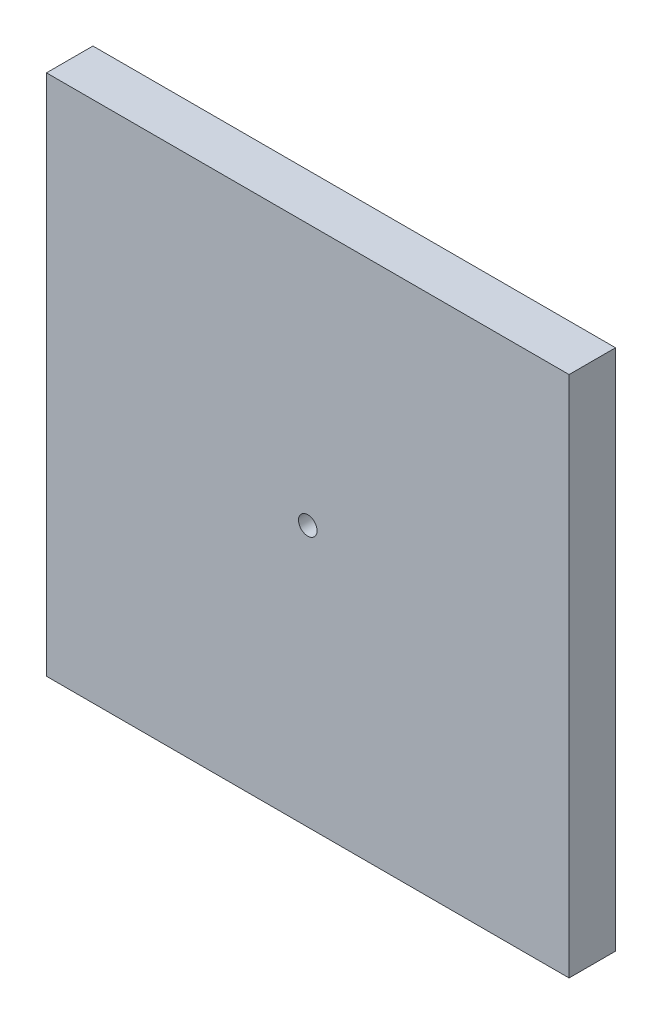
ISO-10303-21;
HEADER;
FILE_DESCRIPTION(('STEP AP214'),'2;1');
FILE_NAME('part.step','',(''),(''),'','','');
FILE_SCHEMA(('AUTOMOTIVE_DESIGN { 1 0 10303 214 1 1 1 1 }'));
ENDSEC;
DATA;
#1=APPLICATION_CONTEXT('core data for automotive mechanical design processes');
#2=APPLICATION_PROTOCOL_DEFINITION('international standard','automotive_design',2000,#1);
#3=PRODUCT_CONTEXT('',#1,'mechanical');
#4=PRODUCT('Part','Part','',(#3));
#5=PRODUCT_RELATED_PRODUCT_CATEGORY('part','',(#4));
#6=PRODUCT_DEFINITION_FORMATION('','',#4);
#7=PRODUCT_DEFINITION_CONTEXT('part definition',#1,'design');
#8=PRODUCT_DEFINITION('design','',#6,#7);
#9=PRODUCT_DEFINITION_SHAPE('','',#8);
#10=(LENGTH_UNIT() NAMED_UNIT(*) SI_UNIT(.MILLI.,.METRE.));
#11=(NAMED_UNIT(*) PLANE_ANGLE_UNIT() SI_UNIT($,.RADIAN.));
#12=(NAMED_UNIT(*) SI_UNIT($,.STERADIAN.) SOLID_ANGLE_UNIT());
#13=UNCERTAINTY_MEASURE_WITH_UNIT(LENGTH_MEASURE(1.E-05),#10,'distance_accuracy_value','');
#14=(GEOMETRIC_REPRESENTATION_CONTEXT(3) GLOBAL_UNCERTAINTY_ASSIGNED_CONTEXT((#13)) GLOBAL_UNIT_ASSIGNED_CONTEXT((#10,
#11,#12)) REPRESENTATION_CONTEXT('',''));
#15=CARTESIAN_POINT('',(0.,0.,0.));
#16=DIRECTION('',(0.,0.,1.));
#17=DIRECTION('',(1.,0.,0.));
#18=AXIS2_PLACEMENT_3D('',#15,#16,#17);
#19=CARTESIAN_POINT('',(0.,0.,4.));
#20=DIRECTION('',(0.,0.,-1.));
#21=DIRECTION('',(-1.,0.,0.));
#22=AXIS2_PLACEMENT_3D('',#19,#20,#21);
#23=PLANE('',#22);
#24=DIRECTION('',(0.,-1.,0.));
#25=VECTOR('',#24,1.);
#26=CARTESIAN_POINT('',(0.,0.,4.));
#27=LINE('',#26,#25);
#28=CARTESIAN_POINT('',(0.,45.,4.));
#29=VERTEX_POINT('',#28);
#30=CARTESIAN_POINT('',(0.,0.,4.));
#31=VERTEX_POINT('',#30);
#32=EDGE_CURVE('E85',#29,#31,#27,.T.);
#33=ORIENTED_EDGE('',*,*,#32,.T.);
#34=DIRECTION('',(1.,0.,0.));
#35=VECTOR('',#34,1.);
#36=CARTESIAN_POINT('',(0.,0.,4.));
#37=LINE('',#36,#35);
#38=CARTESIAN_POINT('',(45.,0.,4.));
#39=VERTEX_POINT('',#38);
#40=EDGE_CURVE('E80',#31,#39,#37,.T.);
#41=ORIENTED_EDGE('',*,*,#40,.T.);
#42=DIRECTION('',(0.,1.,0.));
#43=VECTOR('',#42,1.);
#44=CARTESIAN_POINT('',(45.,0.,4.));
#45=LINE('',#44,#43);
#46=CARTESIAN_POINT('',(45.,45.,4.));
#47=VERTEX_POINT('',#46);
#48=EDGE_CURVE('E83',#39,#47,#45,.T.);
#49=ORIENTED_EDGE('',*,*,#48,.T.);
#50=DIRECTION('',(-1.,0.,0.));
#51=VECTOR('',#50,1.);
#52=CARTESIAN_POINT('',(0.,45.,4.));
#53=LINE('',#52,#51);
#54=EDGE_CURVE('E50',#47,#29,#53,.T.);
#55=ORIENTED_EDGE('',*,*,#54,.T.);
#56=EDGE_LOOP('',(#33,#41,#49,#55));
#57=FACE_BOUND('',#56,.T.);
#58=CARTESIAN_POINT('',(22.5,22.5,4.));
#59=DIRECTION('',(0.,0.,1.));
#60=DIRECTION('',(1.,0.,0.));
#61=AXIS2_PLACEMENT_3D('',#58,#59,#60);
#62=CIRCLE('',#61,0.799999999999999);
#63=CARTESIAN_POINT('',(23.3,22.5,4.));
#64=VERTEX_POINT('',#63);
#65=EDGE_CURVE('E100',#64,#64,#62,.T.);
#66=ORIENTED_EDGE('',*,*,#65,.F.);
#67=EDGE_LOOP('',(#66));
#68=FACE_BOUND('',#67,.T.);
#69=ADVANCED_FACE('F33',(#57,#68),#23,.F.);
#70=CARTESIAN_POINT('',(0.,0.,0.));
#71=DIRECTION('',(0.,0.,-1.));
#72=DIRECTION('',(-1.,0.,0.));
#73=AXIS2_PLACEMENT_3D('',#70,#71,#72);
#74=PLANE('',#73);
#75=DIRECTION('',(0.,-1.,0.));
#76=VECTOR('',#75,1.);
#77=CARTESIAN_POINT('',(0.,0.,0.));
#78=LINE('',#77,#76);
#79=CARTESIAN_POINT('',(0.,45.,0.));
#80=VERTEX_POINT('',#79);
#81=CARTESIAN_POINT('',(0.,0.,0.));
#82=VERTEX_POINT('',#81);
#83=EDGE_CURVE('E97',#80,#82,#78,.T.);
#84=ORIENTED_EDGE('',*,*,#83,.F.);
#85=DIRECTION('',(-1.,0.,0.));
#86=VECTOR('',#85,1.);
#87=CARTESIAN_POINT('',(0.,45.,0.));
#88=LINE('',#87,#86);
#89=CARTESIAN_POINT('',(45.,45.,0.));
#90=VERTEX_POINT('',#89);
#91=EDGE_CURVE('E73',#90,#80,#88,.T.);
#92=ORIENTED_EDGE('',*,*,#91,.F.);
#93=DIRECTION('',(0.,1.,0.));
#94=VECTOR('',#93,1.);
#95=CARTESIAN_POINT('',(45.,0.,0.));
#96=LINE('',#95,#94);
#97=CARTESIAN_POINT('',(45.,0.,0.));
#98=VERTEX_POINT('',#97);
#99=EDGE_CURVE('E67',#98,#90,#96,.T.);
#100=ORIENTED_EDGE('',*,*,#99,.F.);
#101=DIRECTION('',(1.,0.,0.));
#102=VECTOR('',#101,1.);
#103=CARTESIAN_POINT('',(0.,0.,0.));
#104=LINE('',#103,#102);
#105=EDGE_CURVE('E89',#82,#98,#104,.T.);
#106=ORIENTED_EDGE('',*,*,#105,.F.);
#107=EDGE_LOOP('',(#84,#92,#100,#106));
#108=FACE_BOUND('',#107,.T.);
#109=CARTESIAN_POINT('',(22.5,22.5,0.));
#110=DIRECTION('',(0.,0.,1.));
#111=DIRECTION('',(1.,0.,0.));
#112=AXIS2_PLACEMENT_3D('',#109,#110,#111);
#113=CIRCLE('',#112,0.799999999999999);
#114=CARTESIAN_POINT('',(23.3,22.5,0.));
#115=VERTEX_POINT('',#114);
#116=EDGE_CURVE('E112',#115,#115,#113,.T.);
#117=ORIENTED_EDGE('',*,*,#116,.T.);
#118=EDGE_LOOP('',(#117));
#119=FACE_BOUND('',#118,.T.);
#120=ADVANCED_FACE('F108',(#108,#119),#74,.T.);
#121=CARTESIAN_POINT('',(0.,0.,4.));
#122=DIRECTION('',(1.,0.,0.));
#123=DIRECTION('',(0.,0.,-1.));
#124=AXIS2_PLACEMENT_3D('',#121,#122,#123);
#125=PLANE('',#124);
#126=ORIENTED_EDGE('',*,*,#83,.T.);
#127=DIRECTION('',(0.,0.,-1.));
#128=VECTOR('',#127,1.);
#129=CARTESIAN_POINT('',(0.,0.,4.));
#130=LINE('',#129,#128);
#131=EDGE_CURVE('E11',#31,#82,#130,.T.);
#132=ORIENTED_EDGE('',*,*,#131,.F.);
#133=ORIENTED_EDGE('',*,*,#32,.F.);
#134=DIRECTION('',(0.,0.,-1.));
#135=VECTOR('',#134,1.);
#136=CARTESIAN_POINT('',(0.,45.,4.));
#137=LINE('',#136,#135);
#138=EDGE_CURVE('E93',#29,#80,#137,.T.);
#139=ORIENTED_EDGE('',*,*,#138,.T.);
#140=EDGE_LOOP('',(#126,#132,#133,#139));
#141=FACE_BOUND('',#140,.T.);
#142=ADVANCED_FACE('F35',(#141),#125,.F.);
#143=CARTESIAN_POINT('',(0.,0.,4.));
#144=DIRECTION('',(0.,1.,0.));
#145=DIRECTION('',(0.,0.,1.));
#146=AXIS2_PLACEMENT_3D('',#143,#144,#145);
#147=PLANE('',#146);
#148=ORIENTED_EDGE('',*,*,#105,.T.);
#149=DIRECTION('',(0.,0.,-1.));
#150=VECTOR('',#149,1.);
#151=CARTESIAN_POINT('',(45.,0.,4.));
#152=LINE('',#151,#150);
#153=EDGE_CURVE('E42',#39,#98,#152,.T.);
#154=ORIENTED_EDGE('',*,*,#153,.F.);
#155=ORIENTED_EDGE('',*,*,#40,.F.);
#156=ORIENTED_EDGE('',*,*,#131,.T.);
#157=EDGE_LOOP('',(#148,#154,#155,#156));
#158=FACE_BOUND('',#157,.T.);
#159=ADVANCED_FACE('F88',(#158),#147,.F.);
#160=CARTESIAN_POINT('',(45.,0.,4.));
#161=DIRECTION('',(-1.,0.,0.));
#162=DIRECTION('',(0.,0.,1.));
#163=AXIS2_PLACEMENT_3D('',#160,#161,#162);
#164=PLANE('',#163);
#165=ORIENTED_EDGE('',*,*,#99,.T.);
#166=DIRECTION('',(0.,0.,-1.));
#167=VECTOR('',#166,1.);
#168=CARTESIAN_POINT('',(45.,45.,4.));
#169=LINE('',#168,#167);
#170=EDGE_CURVE('E90',#47,#90,#169,.T.);
#171=ORIENTED_EDGE('',*,*,#170,.F.);
#172=ORIENTED_EDGE('',*,*,#48,.F.);
#173=ORIENTED_EDGE('',*,*,#153,.T.);
#174=EDGE_LOOP('',(#165,#171,#172,#173));
#175=FACE_BOUND('',#174,.T.);
#176=ADVANCED_FACE('F91',(#175),#164,.F.);
#177=CARTESIAN_POINT('',(0.,45.,4.));
#178=DIRECTION('',(0.,-1.,0.));
#179=DIRECTION('',(0.,0.,-1.));
#180=AXIS2_PLACEMENT_3D('',#177,#178,#179);
#181=PLANE('',#180);
#182=ORIENTED_EDGE('',*,*,#91,.T.);
#183=ORIENTED_EDGE('',*,*,#138,.F.);
#184=ORIENTED_EDGE('',*,*,#54,.F.);
#185=ORIENTED_EDGE('',*,*,#170,.T.);
#186=EDGE_LOOP('',(#182,#183,#184,#185));
#187=FACE_BOUND('',#186,.T.);
#188=ADVANCED_FACE('F105',(#187),#181,.F.);
#189=CARTESIAN_POINT('',(22.5,22.5,4.));
#190=DIRECTION('',(0.,0.,-1.));
#191=DIRECTION('',(-1.,0.,0.));
#192=AXIS2_PLACEMENT_3D('',#189,#190,#191);
#193=CYLINDRICAL_SURFACE('',#192,0.799999999999999);
#194=ORIENTED_EDGE('',*,*,#65,.T.);
#195=EDGE_LOOP('',(#194));
#196=FACE_BOUND('',#195,.T.);
#197=ORIENTED_EDGE('',*,*,#116,.F.);
#198=EDGE_LOOP('',(#197));
#199=FACE_BOUND('',#198,.T.);
#200=ADVANCED_FACE('F118',(#196,#199),#193,.F.);
#201=CLOSED_SHELL('',(#69,#120,#142,#159,#176,#188,#200));
#202=MANIFOLD_SOLID_BREP('B2',#201);
#203=ADVANCED_BREP_SHAPE_REPRESENTATION('',(#18,#202),#14);
#204=SHAPE_DEFINITION_REPRESENTATION(#9,#203);
ENDSEC;
END-ISO-10303-21;
